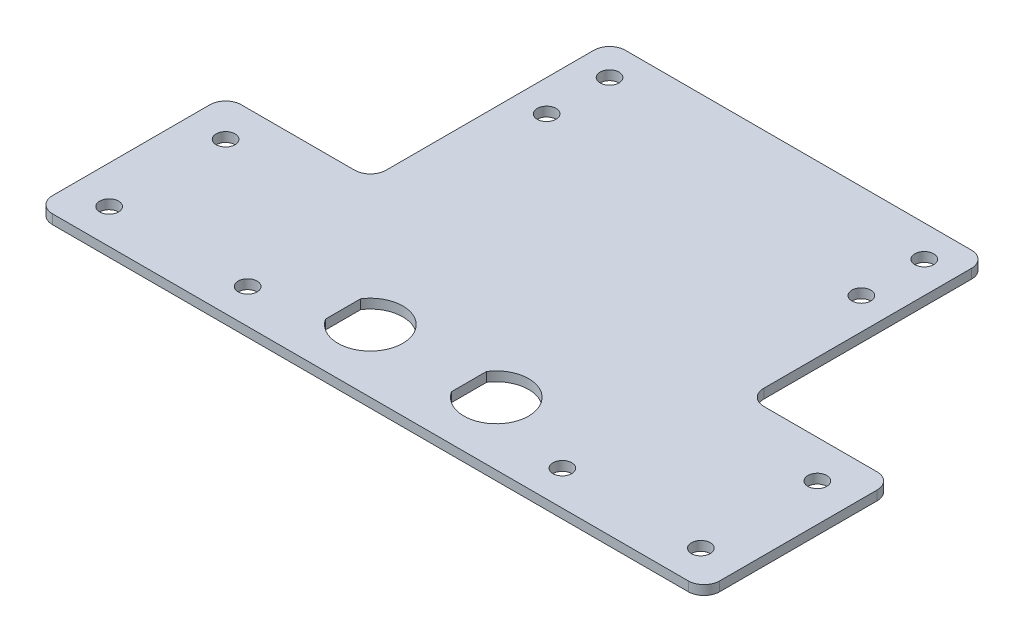
ISO-10303-21;
HEADER;
FILE_DESCRIPTION(('STEP AP214'),'2;1');
FILE_NAME('part.step','',(''),(''),'','','');
FILE_SCHEMA(('AUTOMOTIVE_DESIGN { 1 0 10303 214 1 1 1 1 }'));
ENDSEC;
DATA;
#1=APPLICATION_CONTEXT('core data for automotive mechanical design processes');
#2=APPLICATION_PROTOCOL_DEFINITION('international standard','automotive_design',2000,#1);
#3=PRODUCT_CONTEXT('',#1,'mechanical');
#4=PRODUCT('Part','Part','',(#3));
#5=PRODUCT_RELATED_PRODUCT_CATEGORY('part','',(#4));
#6=PRODUCT_DEFINITION_FORMATION('','',#4);
#7=PRODUCT_DEFINITION_CONTEXT('part definition',#1,'design');
#8=PRODUCT_DEFINITION('design','',#6,#7);
#9=PRODUCT_DEFINITION_SHAPE('','',#8);
#10=(LENGTH_UNIT() NAMED_UNIT(*) SI_UNIT(.MILLI.,.METRE.));
#11=(NAMED_UNIT(*) PLANE_ANGLE_UNIT() SI_UNIT($,.RADIAN.));
#12=(NAMED_UNIT(*) SI_UNIT($,.STERADIAN.) SOLID_ANGLE_UNIT());
#13=UNCERTAINTY_MEASURE_WITH_UNIT(LENGTH_MEASURE(1.E-05),#10,'distance_accuracy_value','');
#14=(GEOMETRIC_REPRESENTATION_CONTEXT(3) GLOBAL_UNCERTAINTY_ASSIGNED_CONTEXT((#13)) GLOBAL_UNIT_ASSIGNED_CONTEXT((#10,
#11,#12)) REPRESENTATION_CONTEXT('',''));
#15=CARTESIAN_POINT('',(0.,0.,0.));
#16=DIRECTION('',(0.,0.,1.));
#17=DIRECTION('',(1.,0.,0.));
#18=AXIS2_PLACEMENT_3D('',#15,#16,#17);
#19=CARTESIAN_POINT('',(-60.,3.,67.5));
#20=DIRECTION('',(-1.,0.,0.));
#21=DIRECTION('',(0.,0.,1.));
#22=AXIS2_PLACEMENT_3D('',#19,#20,#21);
#23=PLANE('',#22);
#24=DIRECTION('',(0.,0.,-1.));
#25=VECTOR('',#24,1.);
#26=CARTESIAN_POINT('',(-60.,3.,67.5));
#27=LINE('',#26,#25);
#28=CARTESIAN_POINT('',(-60.,3.,3.49999999999999));
#29=VERTEX_POINT('',#28);
#30=CARTESIAN_POINT('',(-60.,3.,-62.5));
#31=VERTEX_POINT('',#30);
#32=EDGE_CURVE('E232',#29,#31,#27,.T.);
#33=ORIENTED_EDGE('',*,*,#32,.T.);
#34=DIRECTION('',(0.,-1.,0.));
#35=VECTOR('',#34,1.);
#36=CARTESIAN_POINT('',(-60.,3.,-62.5));
#37=LINE('',#36,#35);
#38=CARTESIAN_POINT('',(-60.,0.,-62.5));
#39=VERTEX_POINT('',#38);
#40=EDGE_CURVE('E171',#31,#39,#37,.T.);
#41=ORIENTED_EDGE('',*,*,#40,.T.);
#42=DIRECTION('',(0.,0.,-1.));
#43=VECTOR('',#42,1.);
#44=CARTESIAN_POINT('',(-60.,0.,67.5));
#45=LINE('',#44,#43);
#46=CARTESIAN_POINT('',(-60.,0.,3.49999999999999));
#47=VERTEX_POINT('',#46);
#48=EDGE_CURVE('E246',#47,#39,#45,.T.);
#49=ORIENTED_EDGE('',*,*,#48,.F.);
#50=DIRECTION('',(0.,1.,0.));
#51=VECTOR('',#50,1.);
#52=CARTESIAN_POINT('',(-60.,3.,3.49999999999999));
#53=LINE('',#52,#51);
#54=EDGE_CURVE('E174',#47,#29,#53,.T.);
#55=ORIENTED_EDGE('',*,*,#54,.T.);
#56=EDGE_LOOP('',(#33,#41,#49,#55));
#57=FACE_BOUND('',#56,.T.);
#58=ADVANCED_FACE('F41',(#57),#23,.T.);
#59=CARTESIAN_POINT('',(60.,3.,-67.5));
#60=DIRECTION('',(1.,0.,0.));
#61=DIRECTION('',(0.,0.,1.));
#62=AXIS2_PLACEMENT_3D('',#59,#60,#61);
#63=PLANE('',#62);
#64=DIRECTION('',(0.,0.,1.));
#65=VECTOR('',#64,1.);
#66=CARTESIAN_POINT('',(60.,3.,-67.5));
#67=LINE('',#66,#65);
#68=CARTESIAN_POINT('',(60.,3.,-62.5));
#69=VERTEX_POINT('',#68);
#70=CARTESIAN_POINT('',(60.,3.,3.5));
#71=VERTEX_POINT('',#70);
#72=EDGE_CURVE('E231',#69,#71,#67,.T.);
#73=ORIENTED_EDGE('',*,*,#72,.T.);
#74=DIRECTION('',(0.,1.,0.));
#75=VECTOR('',#74,1.);
#76=CARTESIAN_POINT('',(60.,0.,3.5));
#77=LINE('',#76,#75);
#78=CARTESIAN_POINT('',(60.,0.,3.5));
#79=VERTEX_POINT('',#78);
#80=EDGE_CURVE('E219',#71,#79,#77,.F.);
#81=ORIENTED_EDGE('',*,*,#80,.T.);
#82=DIRECTION('',(0.,0.,1.));
#83=VECTOR('',#82,1.);
#84=CARTESIAN_POINT('',(60.,0.,-67.5));
#85=LINE('',#84,#83);
#86=CARTESIAN_POINT('',(60.,0.,-62.5));
#87=VERTEX_POINT('',#86);
#88=EDGE_CURVE('E124',#87,#79,#85,.T.);
#89=ORIENTED_EDGE('',*,*,#88,.F.);
#90=DIRECTION('',(0.,-1.,0.));
#91=VECTOR('',#90,1.);
#92=CARTESIAN_POINT('',(60.,3.,-62.5));
#93=LINE('',#92,#91);
#94=EDGE_CURVE('E222',#87,#69,#93,.F.);
#95=ORIENTED_EDGE('',*,*,#94,.T.);
#96=EDGE_LOOP('',(#73,#81,#89,#95));
#97=FACE_BOUND('',#96,.T.);
#98=ADVANCED_FACE('F382',(#97),#63,.T.);
#99=CARTESIAN_POINT('',(-60.,3.,-67.5));
#100=DIRECTION('',(0.,0.,-1.));
#101=DIRECTION('',(0.,-1.,0.));
#102=AXIS2_PLACEMENT_3D('',#99,#100,#101);
#103=PLANE('',#102);
#104=DIRECTION('',(1.,0.,0.));
#105=VECTOR('',#104,1.);
#106=CARTESIAN_POINT('',(-60.,3.,-67.5));
#107=LINE('',#106,#105);
#108=CARTESIAN_POINT('',(-55.,3.,-67.5));
#109=VERTEX_POINT('',#108);
#110=CARTESIAN_POINT('',(55.,3.,-67.5));
#111=VERTEX_POINT('',#110);
#112=EDGE_CURVE('E131',#109,#111,#107,.T.);
#113=ORIENTED_EDGE('',*,*,#112,.T.);
#114=DIRECTION('',(0.,-1.,0.));
#115=VECTOR('',#114,1.);
#116=CARTESIAN_POINT('',(55.,3.,-67.5));
#117=LINE('',#116,#115);
#118=CARTESIAN_POINT('',(55.,0.,-67.5));
#119=VERTEX_POINT('',#118);
#120=EDGE_CURVE('E213',#111,#119,#117,.T.);
#121=ORIENTED_EDGE('',*,*,#120,.T.);
#122=DIRECTION('',(1.,0.,0.));
#123=VECTOR('',#122,1.);
#124=CARTESIAN_POINT('',(-60.,0.,-67.5));
#125=LINE('',#124,#123);
#126=CARTESIAN_POINT('',(-55.,0.,-67.5));
#127=VERTEX_POINT('',#126);
#128=EDGE_CURVE('E240',#127,#119,#125,.T.);
#129=ORIENTED_EDGE('',*,*,#128,.F.);
#130=DIRECTION('',(0.,-1.,0.));
#131=VECTOR('',#130,1.);
#132=CARTESIAN_POINT('',(-55.,3.,-67.5));
#133=LINE('',#132,#131);
#134=EDGE_CURVE('E216',#127,#109,#133,.F.);
#135=ORIENTED_EDGE('',*,*,#134,.T.);
#136=EDGE_LOOP('',(#113,#121,#129,#135));
#137=FACE_BOUND('',#136,.T.);
#138=ADVANCED_FACE('F352',(#137),#103,.T.);
#139=CARTESIAN_POINT('',(0.,3.,0.));
#140=DIRECTION('',(0.,-1.,0.));
#141=DIRECTION('',(0.,0.,-1.));
#142=AXIS2_PLACEMENT_3D('',#139,#140,#141);
#143=PLANE('',#142);
#144=CARTESIAN_POINT('',(-50.,3.,-57.5));
#145=DIRECTION('',(0.,1.,0.));
#146=DIRECTION('',(0.,0.,1.));
#147=AXIS2_PLACEMENT_3D('',#144,#145,#146);
#148=CIRCLE('',#147,3.);
#149=CARTESIAN_POINT('',(-50.,3.,-54.5));
#150=VERTEX_POINT('',#149);
#151=EDGE_CURVE('E331',#150,#150,#148,.T.);
#152=ORIENTED_EDGE('',*,*,#151,.F.);
#153=EDGE_LOOP('',(#152));
#154=FACE_BOUND('',#153,.T.);
#155=CARTESIAN_POINT('',(50.,3.,-57.5));
#156=DIRECTION('',(0.,1.,0.));
#157=DIRECTION('',(0.,0.,-1.));
#158=AXIS2_PLACEMENT_3D('',#155,#156,#157);
#159=CIRCLE('',#158,3.);
#160=CARTESIAN_POINT('',(50.,3.,-60.5));
#161=VERTEX_POINT('',#160);
#162=EDGE_CURVE('E325',#161,#161,#159,.T.);
#163=ORIENTED_EDGE('',*,*,#162,.F.);
#164=EDGE_LOOP('',(#163));
#165=FACE_BOUND('',#164,.T.);
#166=CARTESIAN_POINT('',(50.,3.,57.5));
#167=DIRECTION('',(0.,1.,0.));
#168=DIRECTION('',(0.,0.,-1.));
#169=AXIS2_PLACEMENT_3D('',#166,#167,#168);
#170=CIRCLE('',#169,3.);
#171=CARTESIAN_POINT('',(50.,3.,54.5));
#172=VERTEX_POINT('',#171);
#173=EDGE_CURVE('E319',#172,#172,#170,.T.);
#174=ORIENTED_EDGE('',*,*,#173,.F.);
#175=EDGE_LOOP('',(#174));
#176=FACE_BOUND('',#175,.T.);
#177=CARTESIAN_POINT('',(-50.,3.,-37.5));
#178=DIRECTION('',(0.,1.,0.));
#179=DIRECTION('',(0.,0.,1.));
#180=AXIS2_PLACEMENT_3D('',#177,#178,#179);
#181=CIRCLE('',#180,3.);
#182=CARTESIAN_POINT('',(-50.,3.,-34.5));
#183=VERTEX_POINT('',#182);
#184=EDGE_CURVE('E312',#183,#183,#181,.T.);
#185=ORIENTED_EDGE('',*,*,#184,.F.);
#186=EDGE_LOOP('',(#185));
#187=FACE_BOUND('',#186,.T.);
#188=CARTESIAN_POINT('',(50.,3.,-37.5));
#189=DIRECTION('',(0.,1.,0.));
#190=DIRECTION('',(0.,0.,-1.));
#191=AXIS2_PLACEMENT_3D('',#188,#189,#190);
#192=CIRCLE('',#191,3.);
#193=CARTESIAN_POINT('',(50.,3.,-40.5));
#194=VERTEX_POINT('',#193);
#195=EDGE_CURVE('E116',#194,#194,#192,.T.);
#196=ORIENTED_EDGE('',*,*,#195,.F.);
#197=EDGE_LOOP('',(#196));
#198=FACE_BOUND('',#197,.T.);
#199=CARTESIAN_POINT('',(-50.,3.,57.5));
#200=DIRECTION('',(0.,1.,0.));
#201=DIRECTION('',(0.,0.,1.));
#202=AXIS2_PLACEMENT_3D('',#199,#200,#201);
#203=CIRCLE('',#202,3.);
#204=CARTESIAN_POINT('',(-50.,3.,60.5));
#205=VERTEX_POINT('',#204);
#206=EDGE_CURVE('E306',#205,#205,#203,.T.);
#207=ORIENTED_EDGE('',*,*,#206,.F.);
#208=EDGE_LOOP('',(#207));
#209=FACE_BOUND('',#208,.T.);
#210=ORIENTED_EDGE('',*,*,#72,.F.);
#211=CARTESIAN_POINT('',(55.,3.,-62.5));
#212=DIRECTION('',(0.,-1.,0.));
#213=DIRECTION('',(0.,0.,-1.));
#214=AXIS2_PLACEMENT_3D('',#211,#212,#213);
#215=CIRCLE('',#214,5.);
#216=EDGE_CURVE('E177',#69,#111,#215,.F.);
#217=ORIENTED_EDGE('',*,*,#216,.T.);
#218=ORIENTED_EDGE('',*,*,#112,.F.);
#219=CARTESIAN_POINT('',(-55.,3.,-62.5));
#220=DIRECTION('',(0.,-1.,0.));
#221=DIRECTION('',(0.,0.,-1.));
#222=AXIS2_PLACEMENT_3D('',#219,#220,#221);
#223=CIRCLE('',#222,5.);
#224=EDGE_CURVE('E180',#109,#31,#223,.F.);
#225=ORIENTED_EDGE('',*,*,#224,.T.);
#226=ORIENTED_EDGE('',*,*,#32,.F.);
#227=CARTESIAN_POINT('',(-65.,3.,3.49999999999999));
#228=DIRECTION('',(0.,-1.,0.));
#229=DIRECTION('',(0.,0.,-1.));
#230=AXIS2_PLACEMENT_3D('',#227,#228,#229);
#231=CIRCLE('',#230,5.);
#232=CARTESIAN_POINT('',(-65.,3.,8.5));
#233=VERTEX_POINT('',#232);
#234=EDGE_CURVE('E50',#29,#233,#231,.T.);
#235=ORIENTED_EDGE('',*,*,#234,.T.);
#236=DIRECTION('',(-1.,0.,0.));
#237=VECTOR('',#236,1.);
#238=CARTESIAN_POINT('',(-60.,3.,8.49999999999999));
#239=LINE('',#238,#237);
#240=CARTESIAN_POINT('',(-101.,3.,8.50000000000002));
#241=VERTEX_POINT('',#240);
#242=EDGE_CURVE('E262',#233,#241,#239,.T.);
#243=ORIENTED_EDGE('',*,*,#242,.T.);
#244=CARTESIAN_POINT('',(-101.,3.,13.5));
#245=DIRECTION('',(0.,-1.,0.));
#246=DIRECTION('',(0.,0.,-1.));
#247=AXIS2_PLACEMENT_3D('',#244,#245,#246);
#248=CIRCLE('',#247,5.);
#249=CARTESIAN_POINT('',(-106.,3.,13.5));
#250=VERTEX_POINT('',#249);
#251=EDGE_CURVE('E189',#241,#250,#248,.F.);
#252=ORIENTED_EDGE('',*,*,#251,.T.);
#253=DIRECTION('',(0.,0.,1.));
#254=VECTOR('',#253,1.);
#255=CARTESIAN_POINT('',(-106.,3.,68.5));
#256=LINE('',#255,#254);
#257=CARTESIAN_POINT('',(-106.,3.,63.5));
#258=VERTEX_POINT('',#257);
#259=EDGE_CURVE('E258',#250,#258,#256,.T.);
#260=ORIENTED_EDGE('',*,*,#259,.T.);
#261=CARTESIAN_POINT('',(-101.,3.,63.5));
#262=DIRECTION('',(0.,-1.,0.));
#263=DIRECTION('',(0.,0.,-1.));
#264=AXIS2_PLACEMENT_3D('',#261,#262,#263);
#265=CIRCLE('',#264,5.);
#266=CARTESIAN_POINT('',(-101.,3.,68.5));
#267=VERTEX_POINT('',#266);
#268=EDGE_CURVE('E192',#258,#267,#265,.F.);
#269=ORIENTED_EDGE('',*,*,#268,.T.);
#270=DIRECTION('',(-1.,0.,0.));
#271=VECTOR('',#270,1.);
#272=CARTESIAN_POINT('',(58.,3.,68.5));
#273=LINE('',#272,#271);
#274=CARTESIAN_POINT('',(101.,3.,68.5));
#275=VERTEX_POINT('',#274);
#276=EDGE_CURVE('E236',#275,#267,#273,.T.);
#277=ORIENTED_EDGE('',*,*,#276,.F.);
#278=CARTESIAN_POINT('',(101.,3.,63.5));
#279=DIRECTION('',(0.,-1.,0.));
#280=DIRECTION('',(0.,0.,-1.));
#281=AXIS2_PLACEMENT_3D('',#278,#279,#280);
#282=CIRCLE('',#281,5.);
#283=CARTESIAN_POINT('',(106.,3.,63.5));
#284=VERTEX_POINT('',#283);
#285=EDGE_CURVE('E183',#275,#284,#282,.F.);
#286=ORIENTED_EDGE('',*,*,#285,.T.);
#287=DIRECTION('',(0.,0.,-1.));
#288=VECTOR('',#287,1.);
#289=CARTESIAN_POINT('',(106.,3.,68.5));
#290=LINE('',#289,#288);
#291=CARTESIAN_POINT('',(106.,3.,13.5));
#292=VERTEX_POINT('',#291);
#293=EDGE_CURVE('E282',#284,#292,#290,.T.);
#294=ORIENTED_EDGE('',*,*,#293,.T.);
#295=CARTESIAN_POINT('',(101.,3.,13.5));
#296=DIRECTION('',(0.,-1.,0.));
#297=DIRECTION('',(0.,0.,-1.));
#298=AXIS2_PLACEMENT_3D('',#295,#296,#297);
#299=CIRCLE('',#298,5.);
#300=CARTESIAN_POINT('',(101.,3.,8.50000000000002));
#301=VERTEX_POINT('',#300);
#302=EDGE_CURVE('E186',#292,#301,#299,.F.);
#303=ORIENTED_EDGE('',*,*,#302,.T.);
#304=DIRECTION('',(-1.,0.,0.));
#305=VECTOR('',#304,1.);
#306=CARTESIAN_POINT('',(60.,3.,8.49999999999999));
#307=LINE('',#306,#305);
#308=CARTESIAN_POINT('',(65.,3.,8.5));
#309=VERTEX_POINT('',#308);
#310=EDGE_CURVE('E286',#301,#309,#307,.T.);
#311=ORIENTED_EDGE('',*,*,#310,.T.);
#312=CARTESIAN_POINT('',(65.,3.,3.5));
#313=DIRECTION('',(0.,-1.,0.));
#314=DIRECTION('',(0.,0.,-1.));
#315=AXIS2_PLACEMENT_3D('',#312,#313,#314);
#316=CIRCLE('',#315,5.);
#317=EDGE_CURVE('E144',#309,#71,#316,.T.);
#318=ORIENTED_EDGE('',*,*,#317,.T.);
#319=EDGE_LOOP('',(#210,#217,#218,#225,#226,#235,#243,#252,#260,#269,#277,#286,#294,#303,#311,#318));
#320=FACE_BOUND('',#319,.T.);
#321=CARTESIAN_POINT('',(-20.,3.,48.5));
#322=DIRECTION('',(0.,-1.,0.));
#323=DIRECTION('',(0.,0.,-1.));
#324=AXIS2_PLACEMENT_3D('',#321,#322,#323);
#325=CIRCLE('',#324,10.3);
#326=CARTESIAN_POINT('',(-28.6602540378444,3.,42.9241592562197));
#327=VERTEX_POINT('',#326);
#328=CARTESIAN_POINT('',(-28.6602540378444,3.,54.0758407437803));
#329=VERTEX_POINT('',#328);
#330=EDGE_CURVE('E128',#327,#329,#325,.T.);
#331=ORIENTED_EDGE('',*,*,#330,.T.);
#332=DIRECTION('',(0.,0.,-1.));
#333=VECTOR('',#332,1.);
#334=CARTESIAN_POINT('',(-28.6602540378444,3.,43.5));
#335=LINE('',#334,#333);
#336=EDGE_CURVE('E57',#329,#327,#335,.T.);
#337=ORIENTED_EDGE('',*,*,#336,.T.);
#338=EDGE_LOOP('',(#331,#337));
#339=FACE_BOUND('',#338,.T.);
#340=CARTESIAN_POINT('',(20.,3.,48.5));
#341=DIRECTION('',(0.,-1.,0.));
#342=DIRECTION('',(0.,0.,-1.));
#343=AXIS2_PLACEMENT_3D('',#340,#341,#342);
#344=CIRCLE('',#343,10.3);
#345=CARTESIAN_POINT('',(11.3397459621556,3.,42.9241592562197));
#346=VERTEX_POINT('',#345);
#347=CARTESIAN_POINT('',(11.3397459621556,3.,54.0758407437803));
#348=VERTEX_POINT('',#347);
#349=EDGE_CURVE('E115',#346,#348,#344,.T.);
#350=ORIENTED_EDGE('',*,*,#349,.T.);
#351=DIRECTION('',(0.,0.,-1.));
#352=VECTOR('',#351,1.);
#353=CARTESIAN_POINT('',(11.3397459621556,3.,43.5));
#354=LINE('',#353,#352);
#355=EDGE_CURVE('E65',#348,#346,#354,.T.);
#356=ORIENTED_EDGE('',*,*,#355,.T.);
#357=EDGE_LOOP('',(#350,#356));
#358=FACE_BOUND('',#357,.T.);
#359=CARTESIAN_POINT('',(-94.,3.,57.5));
#360=DIRECTION('',(0.,1.,0.));
#361=DIRECTION('',(0.,0.,-1.));
#362=AXIS2_PLACEMENT_3D('',#359,#360,#361);
#363=CIRCLE('',#362,3.00000000000001);
#364=CARTESIAN_POINT('',(-94.,3.,54.5));
#365=VERTEX_POINT('',#364);
#366=EDGE_CURVE('E276',#365,#365,#363,.T.);
#367=ORIENTED_EDGE('',*,*,#366,.F.);
#368=EDGE_LOOP('',(#367));
#369=FACE_BOUND('',#368,.T.);
#370=CARTESIAN_POINT('',(-94.,3.,20.5));
#371=DIRECTION('',(0.,1.,0.));
#372=DIRECTION('',(0.,0.,-1.));
#373=AXIS2_PLACEMENT_3D('',#370,#371,#372);
#374=CIRCLE('',#373,3.00000000000001);
#375=CARTESIAN_POINT('',(-94.,3.,17.5));
#376=VERTEX_POINT('',#375);
#377=EDGE_CURVE('E270',#376,#376,#374,.T.);
#378=ORIENTED_EDGE('',*,*,#377,.F.);
#379=EDGE_LOOP('',(#378));
#380=FACE_BOUND('',#379,.T.);
#381=CARTESIAN_POINT('',(94.,3.,20.5));
#382=DIRECTION('',(0.,1.,0.));
#383=DIRECTION('',(0.,0.,1.));
#384=AXIS2_PLACEMENT_3D('',#381,#382,#383);
#385=CIRCLE('',#384,3.00000000000001);
#386=CARTESIAN_POINT('',(94.,3.,23.5));
#387=VERTEX_POINT('',#386);
#388=EDGE_CURVE('E300',#387,#387,#385,.T.);
#389=ORIENTED_EDGE('',*,*,#388,.F.);
#390=EDGE_LOOP('',(#389));
#391=FACE_BOUND('',#390,.T.);
#392=CARTESIAN_POINT('',(94.,3.,57.5));
#393=DIRECTION('',(0.,1.,0.));
#394=DIRECTION('',(0.,0.,1.));
#395=AXIS2_PLACEMENT_3D('',#392,#393,#394);
#396=CIRCLE('',#395,3.00000000000001);
#397=CARTESIAN_POINT('',(94.,3.,60.5));
#398=VERTEX_POINT('',#397);
#399=EDGE_CURVE('E294',#398,#398,#396,.T.);
#400=ORIENTED_EDGE('',*,*,#399,.F.);
#401=EDGE_LOOP('',(#400));
#402=FACE_BOUND('',#401,.T.);
#403=ADVANCED_FACE('F350',(#154,#165,#176,#187,#198,#209,#320,#339,#358,#369,#380,#391,#402),
#143,.F.);
#404=CARTESIAN_POINT('',(0.,0.,0.));
#405=DIRECTION('',(0.,-1.,0.));
#406=DIRECTION('',(0.,0.,-1.));
#407=AXIS2_PLACEMENT_3D('',#404,#405,#406);
#408=PLANE('',#407);
#409=CARTESIAN_POINT('',(-50.,0.,-57.5));
#410=DIRECTION('',(0.,1.,0.));
#411=DIRECTION('',(0.,0.,1.));
#412=AXIS2_PLACEMENT_3D('',#409,#410,#411);
#413=CIRCLE('',#412,3.);
#414=CARTESIAN_POINT('',(-50.,0.,-54.5));
#415=VERTEX_POINT('',#414);
#416=EDGE_CURVE('E309',#415,#415,#413,.T.);
#417=ORIENTED_EDGE('',*,*,#416,.T.);
#418=EDGE_LOOP('',(#417));
#419=FACE_BOUND('',#418,.T.);
#420=CARTESIAN_POINT('',(50.,0.,-57.5));
#421=DIRECTION('',(0.,1.,0.));
#422=DIRECTION('',(0.,0.,-1.));
#423=AXIS2_PLACEMENT_3D('',#420,#421,#422);
#424=CIRCLE('',#423,3.);
#425=CARTESIAN_POINT('',(50.,0.,-60.5));
#426=VERTEX_POINT('',#425);
#427=EDGE_CURVE('E328',#426,#426,#424,.T.);
#428=ORIENTED_EDGE('',*,*,#427,.T.);
#429=EDGE_LOOP('',(#428));
#430=FACE_BOUND('',#429,.T.);
#431=CARTESIAN_POINT('',(50.,0.,57.5));
#432=DIRECTION('',(0.,1.,0.));
#433=DIRECTION('',(0.,0.,-1.));
#434=AXIS2_PLACEMENT_3D('',#431,#432,#433);
#435=CIRCLE('',#434,3.);
#436=CARTESIAN_POINT('',(50.,0.,54.5));
#437=VERTEX_POINT('',#436);
#438=EDGE_CURVE('E322',#437,#437,#435,.T.);
#439=ORIENTED_EDGE('',*,*,#438,.T.);
#440=EDGE_LOOP('',(#439));
#441=FACE_BOUND('',#440,.T.);
#442=CARTESIAN_POINT('',(-50.,0.,-37.5));
#443=DIRECTION('',(0.,1.,0.));
#444=DIRECTION('',(0.,0.,1.));
#445=AXIS2_PLACEMENT_3D('',#442,#443,#444);
#446=CIRCLE('',#445,3.);
#447=CARTESIAN_POINT('',(-50.,0.,-34.5));
#448=VERTEX_POINT('',#447);
#449=EDGE_CURVE('E315',#448,#448,#446,.T.);
#450=ORIENTED_EDGE('',*,*,#449,.T.);
#451=EDGE_LOOP('',(#450));
#452=FACE_BOUND('',#451,.T.);
#453=CARTESIAN_POINT('',(50.,0.,-37.5));
#454=DIRECTION('',(0.,1.,0.));
#455=DIRECTION('',(0.,0.,-1.));
#456=AXIS2_PLACEMENT_3D('',#453,#454,#455);
#457=CIRCLE('',#456,3.);
#458=CARTESIAN_POINT('',(50.,0.,-40.5));
#459=VERTEX_POINT('',#458);
#460=EDGE_CURVE('E316',#459,#459,#457,.T.);
#461=ORIENTED_EDGE('',*,*,#460,.T.);
#462=EDGE_LOOP('',(#461));
#463=FACE_BOUND('',#462,.T.);
#464=CARTESIAN_POINT('',(-50.,0.,57.5));
#465=DIRECTION('',(0.,1.,0.));
#466=DIRECTION('',(0.,0.,1.));
#467=AXIS2_PLACEMENT_3D('',#464,#465,#466);
#468=CIRCLE('',#467,3.);
#469=CARTESIAN_POINT('',(-50.,0.,60.5));
#470=VERTEX_POINT('',#469);
#471=EDGE_CURVE('E303',#470,#470,#468,.T.);
#472=ORIENTED_EDGE('',*,*,#471,.T.);
#473=EDGE_LOOP('',(#472));
#474=FACE_BOUND('',#473,.T.);
#475=ORIENTED_EDGE('',*,*,#128,.T.);
#476=CARTESIAN_POINT('',(55.,0.,-62.5));
#477=DIRECTION('',(0.,-1.,0.));
#478=DIRECTION('',(0.,0.,-1.));
#479=AXIS2_PLACEMENT_3D('',#476,#477,#478);
#480=CIRCLE('',#479,5.);
#481=EDGE_CURVE('E195',#119,#87,#480,.T.);
#482=ORIENTED_EDGE('',*,*,#481,.T.);
#483=ORIENTED_EDGE('',*,*,#88,.T.);
#484=CARTESIAN_POINT('',(65.,0.,3.5));
#485=DIRECTION('',(0.,-1.,0.));
#486=DIRECTION('',(0.,0.,-1.));
#487=AXIS2_PLACEMENT_3D('',#484,#485,#486);
#488=CIRCLE('',#487,5.);
#489=CARTESIAN_POINT('',(65.,0.,8.5));
#490=VERTEX_POINT('',#489);
#491=EDGE_CURVE('E141',#79,#490,#488,.F.);
#492=ORIENTED_EDGE('',*,*,#491,.T.);
#493=DIRECTION('',(-1.,0.,0.));
#494=VECTOR('',#493,1.);
#495=CARTESIAN_POINT('',(60.,0.,8.49999999999999));
#496=LINE('',#495,#494);
#497=CARTESIAN_POINT('',(101.,0.,8.50000000000002));
#498=VERTEX_POINT('',#497);
#499=EDGE_CURVE('E285',#498,#490,#496,.T.);
#500=ORIENTED_EDGE('',*,*,#499,.F.);
#501=CARTESIAN_POINT('',(101.,0.,13.5));
#502=DIRECTION('',(0.,-1.,0.));
#503=DIRECTION('',(0.,0.,-1.));
#504=AXIS2_PLACEMENT_3D('',#501,#502,#503);
#505=CIRCLE('',#504,5.);
#506=CARTESIAN_POINT('',(106.,0.,13.5));
#507=VERTEX_POINT('',#506);
#508=EDGE_CURVE('E204',#498,#507,#505,.T.);
#509=ORIENTED_EDGE('',*,*,#508,.T.);
#510=DIRECTION('',(0.,0.,-1.));
#511=VECTOR('',#510,1.);
#512=CARTESIAN_POINT('',(106.,0.,68.5));
#513=LINE('',#512,#511);
#514=CARTESIAN_POINT('',(106.,0.,63.5));
#515=VERTEX_POINT('',#514);
#516=EDGE_CURVE('E279',#515,#507,#513,.T.);
#517=ORIENTED_EDGE('',*,*,#516,.F.);
#518=CARTESIAN_POINT('',(101.,0.,63.5));
#519=DIRECTION('',(0.,-1.,0.));
#520=DIRECTION('',(0.,0.,-1.));
#521=AXIS2_PLACEMENT_3D('',#518,#519,#520);
#522=CIRCLE('',#521,5.);
#523=CARTESIAN_POINT('',(101.,0.,68.5));
#524=VERTEX_POINT('',#523);
#525=EDGE_CURVE('E201',#515,#524,#522,.T.);
#526=ORIENTED_EDGE('',*,*,#525,.T.);
#527=DIRECTION('',(-1.,0.,0.));
#528=VECTOR('',#527,1.);
#529=CARTESIAN_POINT('',(58.,0.,68.5));
#530=LINE('',#529,#528);
#531=CARTESIAN_POINT('',(-101.,0.,68.5));
#532=VERTEX_POINT('',#531);
#533=EDGE_CURVE('E242',#524,#532,#530,.T.);
#534=ORIENTED_EDGE('',*,*,#533,.T.);
#535=CARTESIAN_POINT('',(-101.,0.,63.5));
#536=DIRECTION('',(0.,-1.,0.));
#537=DIRECTION('',(0.,0.,-1.));
#538=AXIS2_PLACEMENT_3D('',#535,#536,#537);
#539=CIRCLE('',#538,5.);
#540=CARTESIAN_POINT('',(-106.,0.,63.5));
#541=VERTEX_POINT('',#540);
#542=EDGE_CURVE('E210',#532,#541,#539,.T.);
#543=ORIENTED_EDGE('',*,*,#542,.T.);
#544=DIRECTION('',(0.,0.,1.));
#545=VECTOR('',#544,1.);
#546=CARTESIAN_POINT('',(-106.,0.,68.5));
#547=LINE('',#546,#545);
#548=CARTESIAN_POINT('',(-106.,0.,13.5));
#549=VERTEX_POINT('',#548);
#550=EDGE_CURVE('E241',#549,#541,#547,.T.);
#551=ORIENTED_EDGE('',*,*,#550,.F.);
#552=CARTESIAN_POINT('',(-101.,0.,13.5));
#553=DIRECTION('',(0.,-1.,0.));
#554=DIRECTION('',(0.,0.,-1.));
#555=AXIS2_PLACEMENT_3D('',#552,#553,#554);
#556=CIRCLE('',#555,5.);
#557=CARTESIAN_POINT('',(-101.,0.,8.50000000000002));
#558=VERTEX_POINT('',#557);
#559=EDGE_CURVE('E207',#549,#558,#556,.T.);
#560=ORIENTED_EDGE('',*,*,#559,.T.);
#561=DIRECTION('',(-1.,0.,0.));
#562=VECTOR('',#561,1.);
#563=CARTESIAN_POINT('',(-60.,0.,8.49999999999999));
#564=LINE('',#563,#562);
#565=CARTESIAN_POINT('',(-65.,0.,8.5));
#566=VERTEX_POINT('',#565);
#567=EDGE_CURVE('E261',#566,#558,#564,.T.);
#568=ORIENTED_EDGE('',*,*,#567,.F.);
#569=CARTESIAN_POINT('',(-65.,0.,3.49999999999999));
#570=DIRECTION('',(0.,-1.,0.));
#571=DIRECTION('',(0.,0.,-1.));
#572=AXIS2_PLACEMENT_3D('',#569,#570,#571);
#573=CIRCLE('',#572,5.);
#574=EDGE_CURVE('E12',#566,#47,#573,.F.);
#575=ORIENTED_EDGE('',*,*,#574,.T.);
#576=ORIENTED_EDGE('',*,*,#48,.T.);
#577=CARTESIAN_POINT('',(-55.,0.,-62.5));
#578=DIRECTION('',(0.,-1.,0.));
#579=DIRECTION('',(0.,0.,-1.));
#580=AXIS2_PLACEMENT_3D('',#577,#578,#579);
#581=CIRCLE('',#580,5.);
#582=EDGE_CURVE('E198',#39,#127,#581,.T.);
#583=ORIENTED_EDGE('',*,*,#582,.T.);
#584=EDGE_LOOP('',(#475,#482,#483,#492,#500,#509,#517,#526,#534,#543,#551,#560,#568,#575,#576,#583));
#585=FACE_BOUND('',#584,.T.);
#586=CARTESIAN_POINT('',(-20.,0.,48.5));
#587=DIRECTION('',(0.,-1.,0.));
#588=DIRECTION('',(0.,0.,-1.));
#589=AXIS2_PLACEMENT_3D('',#586,#587,#588);
#590=CIRCLE('',#589,10.3);
#591=CARTESIAN_POINT('',(-20.,0.,38.2));
#592=VERTEX_POINT('',#591);
#593=CARTESIAN_POINT('',(-28.6602540378444,0.,42.9241592562197));
#594=VERTEX_POINT('',#593);
#595=EDGE_CURVE('E122',#592,#594,#590,.F.);
#596=ORIENTED_EDGE('',*,*,#595,.T.);
#597=DIRECTION('',(0.,0.,-1.));
#598=VECTOR('',#597,1.);
#599=CARTESIAN_POINT('',(-28.6602540378444,0.,43.5));
#600=LINE('',#599,#598);
#601=CARTESIAN_POINT('',(-28.6602540378444,0.,54.0758407437803));
#602=VERTEX_POINT('',#601);
#603=EDGE_CURVE('E88',#602,#594,#600,.T.);
#604=ORIENTED_EDGE('',*,*,#603,.F.);
#605=CARTESIAN_POINT('',(-20.,0.,48.5));
#606=DIRECTION('',(0.,-1.,0.));
#607=DIRECTION('',(0.,0.,-1.));
#608=AXIS2_PLACEMENT_3D('',#605,#606,#607);
#609=CIRCLE('',#608,10.3);
#610=EDGE_CURVE('E120',#602,#592,#609,.F.);
#611=ORIENTED_EDGE('',*,*,#610,.T.);
#612=EDGE_LOOP('',(#596,#604,#611));
#613=FACE_BOUND('',#612,.T.);
#614=CARTESIAN_POINT('',(20.,0.,48.5));
#615=DIRECTION('',(0.,-1.,0.));
#616=DIRECTION('',(0.,0.,-1.));
#617=AXIS2_PLACEMENT_3D('',#614,#615,#616);
#618=CIRCLE('',#617,10.3);
#619=CARTESIAN_POINT('',(20.,0.,38.2));
#620=VERTEX_POINT('',#619);
#621=CARTESIAN_POINT('',(11.3397459621556,0.,42.9241592562197));
#622=VERTEX_POINT('',#621);
#623=EDGE_CURVE('E114',#620,#622,#618,.F.);
#624=ORIENTED_EDGE('',*,*,#623,.T.);
#625=DIRECTION('',(0.,0.,-1.));
#626=VECTOR('',#625,1.);
#627=CARTESIAN_POINT('',(11.3397459621556,0.,43.5));
#628=LINE('',#627,#626);
#629=CARTESIAN_POINT('',(11.3397459621556,0.,54.0758407437803));
#630=VERTEX_POINT('',#629);
#631=EDGE_CURVE('E105',#630,#622,#628,.T.);
#632=ORIENTED_EDGE('',*,*,#631,.F.);
#633=CARTESIAN_POINT('',(20.,0.,48.5));
#634=DIRECTION('',(0.,-1.,0.));
#635=DIRECTION('',(0.,0.,-1.));
#636=AXIS2_PLACEMENT_3D('',#633,#634,#635);
#637=CIRCLE('',#636,10.3);
#638=EDGE_CURVE('E102',#630,#620,#637,.F.);
#639=ORIENTED_EDGE('',*,*,#638,.T.);
#640=EDGE_LOOP('',(#624,#632,#639));
#641=FACE_BOUND('',#640,.T.);
#642=CARTESIAN_POINT('',(-94.,0.,57.5));
#643=DIRECTION('',(0.,1.,0.));
#644=DIRECTION('',(0.,0.,-1.));
#645=AXIS2_PLACEMENT_3D('',#642,#643,#644);
#646=CIRCLE('',#645,3.00000000000001);
#647=CARTESIAN_POINT('',(-94.,0.,54.5));
#648=VERTEX_POINT('',#647);
#649=EDGE_CURVE('E273',#648,#648,#646,.T.);
#650=ORIENTED_EDGE('',*,*,#649,.T.);
#651=EDGE_LOOP('',(#650));
#652=FACE_BOUND('',#651,.T.);
#653=CARTESIAN_POINT('',(-94.,0.,20.5));
#654=DIRECTION('',(0.,1.,0.));
#655=DIRECTION('',(0.,0.,-1.));
#656=AXIS2_PLACEMENT_3D('',#653,#654,#655);
#657=CIRCLE('',#656,3.00000000000001);
#658=CARTESIAN_POINT('',(-94.,0.,17.5));
#659=VERTEX_POINT('',#658);
#660=EDGE_CURVE('E265',#659,#659,#657,.T.);
#661=ORIENTED_EDGE('',*,*,#660,.T.);
#662=EDGE_LOOP('',(#661));
#663=FACE_BOUND('',#662,.T.);
#664=CARTESIAN_POINT('',(94.,0.,20.5));
#665=DIRECTION('',(0.,1.,0.));
#666=DIRECTION('',(0.,0.,1.));
#667=AXIS2_PLACEMENT_3D('',#664,#665,#666);
#668=CIRCLE('',#667,3.00000000000001);
#669=CARTESIAN_POINT('',(94.,0.,23.5));
#670=VERTEX_POINT('',#669);
#671=EDGE_CURVE('E297',#670,#670,#668,.T.);
#672=ORIENTED_EDGE('',*,*,#671,.T.);
#673=EDGE_LOOP('',(#672));
#674=FACE_BOUND('',#673,.T.);
#675=CARTESIAN_POINT('',(94.,0.,57.5));
#676=DIRECTION('',(0.,1.,0.));
#677=DIRECTION('',(0.,0.,1.));
#678=AXIS2_PLACEMENT_3D('',#675,#676,#677);
#679=CIRCLE('',#678,3.00000000000001);
#680=CARTESIAN_POINT('',(94.,0.,60.5));
#681=VERTEX_POINT('',#680);
#682=EDGE_CURVE('E289',#681,#681,#679,.T.);
#683=ORIENTED_EDGE('',*,*,#682,.T.);
#684=EDGE_LOOP('',(#683));
#685=FACE_BOUND('',#684,.T.);
#686=ADVANCED_FACE('F118',(#419,#430,#441,#452,#463,#474,#585,#613,#641,#652,#663,#674,#685),
#408,.T.);
#687=CARTESIAN_POINT('',(58.,0.,68.5));
#688=DIRECTION('',(0.,0.,-1.));
#689=DIRECTION('',(0.,-1.,0.));
#690=AXIS2_PLACEMENT_3D('',#687,#688,#689);
#691=PLANE('',#690);
#692=ORIENTED_EDGE('',*,*,#533,.F.);
#693=DIRECTION('',(0.,1.,0.));
#694=VECTOR('',#693,1.);
#695=CARTESIAN_POINT('',(101.,3.,68.5));
#696=LINE('',#695,#694);
#697=EDGE_CURVE('E159',#524,#275,#696,.T.);
#698=ORIENTED_EDGE('',*,*,#697,.T.);
#699=ORIENTED_EDGE('',*,*,#276,.T.);
#700=DIRECTION('',(0.,1.,0.));
#701=VECTOR('',#700,1.);
#702=CARTESIAN_POINT('',(-101.,0.,68.5));
#703=LINE('',#702,#701);
#704=EDGE_CURVE('E162',#267,#532,#703,.F.);
#705=ORIENTED_EDGE('',*,*,#704,.T.);
#706=EDGE_LOOP('',(#692,#698,#699,#705));
#707=FACE_BOUND('',#706,.T.);
#708=ADVANCED_FACE('F392',(#707),#691,.F.);
#709=CARTESIAN_POINT('',(20.,-140.624572252627,48.5));
#710=DIRECTION('',(0.,1.,0.));
#711=DIRECTION('',(0.,0.,1.));
#712=AXIS2_PLACEMENT_3D('',#709,#710,#711);
#713=CYLINDRICAL_SURFACE('',#712,10.3);
#714=ORIENTED_EDGE('',*,*,#349,.F.);
#715=DIRECTION('',(0.,1.,0.));
#716=VECTOR('',#715,1.);
#717=CARTESIAN_POINT('',(11.3397459621556,0.,42.9241592562197));
#718=LINE('',#717,#716);
#719=EDGE_CURVE('E108',#622,#346,#718,.T.);
#720=ORIENTED_EDGE('',*,*,#719,.F.);
#721=ORIENTED_EDGE('',*,*,#623,.F.);
#722=ORIENTED_EDGE('',*,*,#638,.F.);
#723=DIRECTION('',(0.,1.,0.));
#724=VECTOR('',#723,1.);
#725=CARTESIAN_POINT('',(11.3397459621556,-140.624572252627,54.0758407437803));
#726=LINE('',#725,#724);
#727=EDGE_CURVE('E110',#630,#348,#726,.T.);
#728=ORIENTED_EDGE('',*,*,#727,.T.);
#729=EDGE_LOOP('',(#714,#720,#721,#722,#728));
#730=FACE_BOUND('',#729,.T.);
#731=ADVANCED_FACE('F113',(#730),#713,.F.);
#732=CARTESIAN_POINT('',(-20.,-140.624572252627,48.5));
#733=DIRECTION('',(0.,1.,0.));
#734=DIRECTION('',(0.,0.,1.));
#735=AXIS2_PLACEMENT_3D('',#732,#733,#734);
#736=CYLINDRICAL_SURFACE('',#735,10.3);
#737=ORIENTED_EDGE('',*,*,#330,.F.);
#738=DIRECTION('',(0.,1.,0.));
#739=VECTOR('',#738,1.);
#740=CARTESIAN_POINT('',(-28.6602540378444,0.,42.9241592562197));
#741=LINE('',#740,#739);
#742=EDGE_CURVE('E45',#594,#327,#741,.T.);
#743=ORIENTED_EDGE('',*,*,#742,.F.);
#744=ORIENTED_EDGE('',*,*,#595,.F.);
#745=ORIENTED_EDGE('',*,*,#610,.F.);
#746=DIRECTION('',(0.,1.,0.));
#747=VECTOR('',#746,1.);
#748=CARTESIAN_POINT('',(-28.6602540378444,-140.624572252627,54.0758407437803));
#749=LINE('',#748,#747);
#750=EDGE_CURVE('E132',#602,#329,#749,.T.);
#751=ORIENTED_EDGE('',*,*,#750,.T.);
#752=EDGE_LOOP('',(#737,#743,#744,#745,#751));
#753=FACE_BOUND('',#752,.T.);
#754=ADVANCED_FACE('F43',(#753),#736,.F.);
#755=CARTESIAN_POINT('',(-60.,0.,8.49999999999999));
#756=DIRECTION('',(0.,0.,-1.));
#757=DIRECTION('',(-1.,0.,0.));
#758=AXIS2_PLACEMENT_3D('',#755,#756,#757);
#759=PLANE('',#758);
#760=ORIENTED_EDGE('',*,*,#242,.F.);
#761=DIRECTION('',(0.,1.,0.));
#762=VECTOR('',#761,1.);
#763=CARTESIAN_POINT('',(-65.,0.,8.5));
#764=LINE('',#763,#762);
#765=EDGE_CURVE('E165',#233,#566,#764,.F.);
#766=ORIENTED_EDGE('',*,*,#765,.T.);
#767=ORIENTED_EDGE('',*,*,#567,.T.);
#768=DIRECTION('',(0.,1.,0.));
#769=VECTOR('',#768,1.);
#770=CARTESIAN_POINT('',(-101.,0.,8.50000000000002));
#771=LINE('',#770,#769);
#772=EDGE_CURVE('E168',#558,#241,#771,.T.);
#773=ORIENTED_EDGE('',*,*,#772,.T.);
#774=EDGE_LOOP('',(#760,#766,#767,#773));
#775=FACE_BOUND('',#774,.T.);
#776=ADVANCED_FACE('F434',(#775),#759,.T.);
#777=CARTESIAN_POINT('',(-106.,0.,68.5));
#778=DIRECTION('',(-1.,0.,0.));
#779=DIRECTION('',(0.,0.,1.));
#780=AXIS2_PLACEMENT_3D('',#777,#778,#779);
#781=PLANE('',#780);
#782=ORIENTED_EDGE('',*,*,#259,.F.);
#783=DIRECTION('',(0.,1.,0.));
#784=VECTOR('',#783,1.);
#785=CARTESIAN_POINT('',(-106.,0.,13.5));
#786=LINE('',#785,#784);
#787=EDGE_CURVE('E147',#250,#549,#786,.F.);
#788=ORIENTED_EDGE('',*,*,#787,.T.);
#789=ORIENTED_EDGE('',*,*,#550,.T.);
#790=DIRECTION('',(0.,1.,0.));
#791=VECTOR('',#790,1.);
#792=CARTESIAN_POINT('',(-106.,3.,63.5));
#793=LINE('',#792,#791);
#794=EDGE_CURVE('E150',#541,#258,#793,.T.);
#795=ORIENTED_EDGE('',*,*,#794,.T.);
#796=EDGE_LOOP('',(#782,#788,#789,#795));
#797=FACE_BOUND('',#796,.T.);
#798=ADVANCED_FACE('F495',(#797),#781,.T.);
#799=CARTESIAN_POINT('',(-94.,0.,20.5));
#800=DIRECTION('',(0.,1.,0.));
#801=DIRECTION('',(0.,0.,1.));
#802=AXIS2_PLACEMENT_3D('',#799,#800,#801);
#803=CYLINDRICAL_SURFACE('',#802,3.00000000000001);
#804=ORIENTED_EDGE('',*,*,#660,.F.);
#805=EDGE_LOOP('',(#804));
#806=FACE_BOUND('',#805,.T.);
#807=ORIENTED_EDGE('',*,*,#377,.T.);
#808=EDGE_LOOP('',(#807));
#809=FACE_BOUND('',#808,.T.);
#810=ADVANCED_FACE('F557',(#806,#809),#803,.F.);
#811=CARTESIAN_POINT('',(-94.,0.,57.5));
#812=DIRECTION('',(0.,1.,0.));
#813=DIRECTION('',(0.,0.,1.));
#814=AXIS2_PLACEMENT_3D('',#811,#812,#813);
#815=CYLINDRICAL_SURFACE('',#814,3.00000000000001);
#816=ORIENTED_EDGE('',*,*,#649,.F.);
#817=EDGE_LOOP('',(#816));
#818=FACE_BOUND('',#817,.T.);
#819=ORIENTED_EDGE('',*,*,#366,.T.);
#820=EDGE_LOOP('',(#819));
#821=FACE_BOUND('',#820,.T.);
#822=ADVANCED_FACE('F552',(#818,#821),#815,.F.);
#823=CARTESIAN_POINT('',(60.,0.,8.49999999999999));
#824=DIRECTION('',(0.,0.,-1.));
#825=DIRECTION('',(-1.,0.,0.));
#826=AXIS2_PLACEMENT_3D('',#823,#824,#825);
#827=PLANE('',#826);
#828=ORIENTED_EDGE('',*,*,#499,.T.);
#829=DIRECTION('',(0.,1.,0.));
#830=VECTOR('',#829,1.);
#831=CARTESIAN_POINT('',(65.,3.,8.5));
#832=LINE('',#831,#830);
#833=EDGE_CURVE('E225',#490,#309,#832,.T.);
#834=ORIENTED_EDGE('',*,*,#833,.T.);
#835=ORIENTED_EDGE('',*,*,#310,.F.);
#836=DIRECTION('',(0.,1.,0.));
#837=VECTOR('',#836,1.);
#838=CARTESIAN_POINT('',(101.,0.,8.50000000000002));
#839=LINE('',#838,#837);
#840=EDGE_CURVE('E228',#301,#498,#839,.F.);
#841=ORIENTED_EDGE('',*,*,#840,.T.);
#842=EDGE_LOOP('',(#828,#834,#835,#841));
#843=FACE_BOUND('',#842,.T.);
#844=ADVANCED_FACE('F377',(#843),#827,.T.);
#845=CARTESIAN_POINT('',(106.,0.,68.5));
#846=DIRECTION('',(1.,0.,0.));
#847=DIRECTION('',(0.,0.,-1.));
#848=AXIS2_PLACEMENT_3D('',#845,#846,#847);
#849=PLANE('',#848);
#850=ORIENTED_EDGE('',*,*,#293,.F.);
#851=DIRECTION('',(0.,1.,0.));
#852=VECTOR('',#851,1.);
#853=CARTESIAN_POINT('',(106.,0.,63.5));
#854=LINE('',#853,#852);
#855=EDGE_CURVE('E153',#284,#515,#854,.F.);
#856=ORIENTED_EDGE('',*,*,#855,.T.);
#857=ORIENTED_EDGE('',*,*,#516,.T.);
#858=DIRECTION('',(0.,1.,0.));
#859=VECTOR('',#858,1.);
#860=CARTESIAN_POINT('',(106.,0.,13.5));
#861=LINE('',#860,#859);
#862=EDGE_CURVE('E156',#507,#292,#861,.T.);
#863=ORIENTED_EDGE('',*,*,#862,.T.);
#864=EDGE_LOOP('',(#850,#856,#857,#863));
#865=FACE_BOUND('',#864,.T.);
#866=ADVANCED_FACE('F367',(#865),#849,.T.);
#867=CARTESIAN_POINT('',(94.,0.,57.5));
#868=DIRECTION('',(0.,1.,0.));
#869=DIRECTION('',(0.,0.,1.));
#870=AXIS2_PLACEMENT_3D('',#867,#868,#869);
#871=CYLINDRICAL_SURFACE('',#870,3.00000000000001);
#872=ORIENTED_EDGE('',*,*,#682,.F.);
#873=EDGE_LOOP('',(#872));
#874=FACE_BOUND('',#873,.T.);
#875=ORIENTED_EDGE('',*,*,#399,.T.);
#876=EDGE_LOOP('',(#875));
#877=FACE_BOUND('',#876,.T.);
#878=ADVANCED_FACE('F364',(#874,#877),#871,.F.);
#879=CARTESIAN_POINT('',(94.,0.,20.5));
#880=DIRECTION('',(0.,1.,0.));
#881=DIRECTION('',(0.,0.,1.));
#882=AXIS2_PLACEMENT_3D('',#879,#880,#881);
#883=CYLINDRICAL_SURFACE('',#882,3.00000000000001);
#884=ORIENTED_EDGE('',*,*,#671,.F.);
#885=EDGE_LOOP('',(#884));
#886=FACE_BOUND('',#885,.T.);
#887=ORIENTED_EDGE('',*,*,#388,.T.);
#888=EDGE_LOOP('',(#887));
#889=FACE_BOUND('',#888,.T.);
#890=ADVANCED_FACE('F366',(#886,#889),#883,.F.);
#891=CARTESIAN_POINT('',(-50.,0.,57.5));
#892=DIRECTION('',(0.,1.,0.));
#893=DIRECTION('',(0.,0.,1.));
#894=AXIS2_PLACEMENT_3D('',#891,#892,#893);
#895=CYLINDRICAL_SURFACE('',#894,3.);
#896=ORIENTED_EDGE('',*,*,#471,.F.);
#897=EDGE_LOOP('',(#896));
#898=FACE_BOUND('',#897,.T.);
#899=ORIENTED_EDGE('',*,*,#206,.T.);
#900=EDGE_LOOP('',(#899));
#901=FACE_BOUND('',#900,.T.);
#902=ADVANCED_FACE('F374',(#898,#901),#895,.F.);
#903=CARTESIAN_POINT('',(50.,0.,-37.5));
#904=DIRECTION('',(0.,1.,0.));
#905=DIRECTION('',(0.,0.,1.));
#906=AXIS2_PLACEMENT_3D('',#903,#904,#905);
#907=CYLINDRICAL_SURFACE('',#906,3.);
#908=ORIENTED_EDGE('',*,*,#460,.F.);
#909=EDGE_LOOP('',(#908));
#910=FACE_BOUND('',#909,.T.);
#911=ORIENTED_EDGE('',*,*,#195,.T.);
#912=EDGE_LOOP('',(#911));
#913=FACE_BOUND('',#912,.T.);
#914=ADVANCED_FACE('F679',(#910,#913),#907,.F.);
#915=CARTESIAN_POINT('',(-50.,0.,-37.5));
#916=DIRECTION('',(0.,1.,0.));
#917=DIRECTION('',(0.,0.,1.));
#918=AXIS2_PLACEMENT_3D('',#915,#916,#917);
#919=CYLINDRICAL_SURFACE('',#918,3.);
#920=ORIENTED_EDGE('',*,*,#449,.F.);
#921=EDGE_LOOP('',(#920));
#922=FACE_BOUND('',#921,.T.);
#923=ORIENTED_EDGE('',*,*,#184,.T.);
#924=EDGE_LOOP('',(#923));
#925=FACE_BOUND('',#924,.T.);
#926=ADVANCED_FACE('F670',(#922,#925),#919,.F.);
#927=CARTESIAN_POINT('',(50.,0.,57.5));
#928=DIRECTION('',(0.,1.,0.));
#929=DIRECTION('',(0.,0.,1.));
#930=AXIS2_PLACEMENT_3D('',#927,#928,#929);
#931=CYLINDRICAL_SURFACE('',#930,3.);
#932=ORIENTED_EDGE('',*,*,#438,.F.);
#933=EDGE_LOOP('',(#932));
#934=FACE_BOUND('',#933,.T.);
#935=ORIENTED_EDGE('',*,*,#173,.T.);
#936=EDGE_LOOP('',(#935));
#937=FACE_BOUND('',#936,.T.);
#938=ADVANCED_FACE('F662',(#934,#937),#931,.F.);
#939=CARTESIAN_POINT('',(50.,0.,-57.5));
#940=DIRECTION('',(0.,1.,0.));
#941=DIRECTION('',(0.,0.,1.));
#942=AXIS2_PLACEMENT_3D('',#939,#940,#941);
#943=CYLINDRICAL_SURFACE('',#942,3.);
#944=ORIENTED_EDGE('',*,*,#427,.F.);
#945=EDGE_LOOP('',(#944));
#946=FACE_BOUND('',#945,.T.);
#947=ORIENTED_EDGE('',*,*,#162,.T.);
#948=EDGE_LOOP('',(#947));
#949=FACE_BOUND('',#948,.T.);
#950=ADVANCED_FACE('F652',(#946,#949),#943,.F.);
#951=CARTESIAN_POINT('',(-50.,0.,-57.5));
#952=DIRECTION('',(0.,1.,0.));
#953=DIRECTION('',(0.,0.,1.));
#954=AXIS2_PLACEMENT_3D('',#951,#952,#953);
#955=CYLINDRICAL_SURFACE('',#954,3.);
#956=ORIENTED_EDGE('',*,*,#416,.F.);
#957=EDGE_LOOP('',(#956));
#958=FACE_BOUND('',#957,.T.);
#959=ORIENTED_EDGE('',*,*,#151,.T.);
#960=EDGE_LOOP('',(#959));
#961=FACE_BOUND('',#960,.T.);
#962=ADVANCED_FACE('F401',(#958,#961),#955,.F.);
#963=CARTESIAN_POINT('',(65.,0.,3.5));
#964=DIRECTION('',(0.,-1.,0.));
#965=DIRECTION('',(1.,0.,0.));
#966=AXIS2_PLACEMENT_3D('',#963,#964,#965);
#967=CYLINDRICAL_SURFACE('',#966,5.);
#968=ORIENTED_EDGE('',*,*,#491,.F.);
#969=ORIENTED_EDGE('',*,*,#80,.F.);
#970=ORIENTED_EDGE('',*,*,#317,.F.);
#971=ORIENTED_EDGE('',*,*,#833,.F.);
#972=EDGE_LOOP('',(#968,#969,#970,#971));
#973=FACE_BOUND('',#972,.T.);
#974=ADVANCED_FACE('F397',(#973),#967,.F.);
#975=CARTESIAN_POINT('',(55.,3.,-62.5));
#976=DIRECTION('',(0.,-1.,0.));
#977=DIRECTION('',(1.,0.,0.));
#978=AXIS2_PLACEMENT_3D('',#975,#976,#977);
#979=CYLINDRICAL_SURFACE('',#978,5.);
#980=ORIENTED_EDGE('',*,*,#216,.F.);
#981=ORIENTED_EDGE('',*,*,#94,.F.);
#982=ORIENTED_EDGE('',*,*,#481,.F.);
#983=ORIENTED_EDGE('',*,*,#120,.F.);
#984=EDGE_LOOP('',(#980,#981,#982,#983));
#985=FACE_BOUND('',#984,.T.);
#986=ADVANCED_FACE('F400',(#985),#979,.T.);
#987=CARTESIAN_POINT('',(-55.,3.,-62.5));
#988=DIRECTION('',(0.,-1.,0.));
#989=DIRECTION('',(0.,0.,-1.));
#990=AXIS2_PLACEMENT_3D('',#987,#988,#989);
#991=CYLINDRICAL_SURFACE('',#990,5.);
#992=ORIENTED_EDGE('',*,*,#224,.F.);
#993=ORIENTED_EDGE('',*,*,#134,.F.);
#994=ORIENTED_EDGE('',*,*,#582,.F.);
#995=ORIENTED_EDGE('',*,*,#40,.F.);
#996=EDGE_LOOP('',(#992,#993,#994,#995));
#997=FACE_BOUND('',#996,.T.);
#998=ADVANCED_FACE('F405',(#997),#991,.T.);
#999=CARTESIAN_POINT('',(-65.,3.,3.49999999999999));
#1000=DIRECTION('',(0.,-1.,0.));
#1001=DIRECTION('',(0.,0.,-1.));
#1002=AXIS2_PLACEMENT_3D('',#999,#1000,#1001);
#1003=CYLINDRICAL_SURFACE('',#1002,5.);
#1004=ORIENTED_EDGE('',*,*,#574,.F.);
#1005=ORIENTED_EDGE('',*,*,#765,.F.);
#1006=ORIENTED_EDGE('',*,*,#234,.F.);
#1007=ORIENTED_EDGE('',*,*,#54,.F.);
#1008=EDGE_LOOP('',(#1004,#1005,#1006,#1007));
#1009=FACE_BOUND('',#1008,.T.);
#1010=ADVANCED_FACE('F409',(#1009),#1003,.F.);
#1011=CARTESIAN_POINT('',(101.,0.,63.5));
#1012=DIRECTION('',(0.,-1.,0.));
#1013=DIRECTION('',(0.,0.,-1.));
#1014=AXIS2_PLACEMENT_3D('',#1011,#1012,#1013);
#1015=CYLINDRICAL_SURFACE('',#1014,5.);
#1016=ORIENTED_EDGE('',*,*,#525,.F.);
#1017=ORIENTED_EDGE('',*,*,#855,.F.);
#1018=ORIENTED_EDGE('',*,*,#285,.F.);
#1019=ORIENTED_EDGE('',*,*,#697,.F.);
#1020=EDGE_LOOP('',(#1016,#1017,#1018,#1019));
#1021=FACE_BOUND('',#1020,.T.);
#1022=ADVANCED_FACE('F413',(#1021),#1015,.T.);
#1023=CARTESIAN_POINT('',(101.,0.,13.5));
#1024=DIRECTION('',(0.,1.,0.));
#1025=DIRECTION('',(0.,0.,1.));
#1026=AXIS2_PLACEMENT_3D('',#1023,#1024,#1025);
#1027=CYLINDRICAL_SURFACE('',#1026,5.);
#1028=ORIENTED_EDGE('',*,*,#508,.F.);
#1029=ORIENTED_EDGE('',*,*,#840,.F.);
#1030=ORIENTED_EDGE('',*,*,#302,.F.);
#1031=ORIENTED_EDGE('',*,*,#862,.F.);
#1032=EDGE_LOOP('',(#1028,#1029,#1030,#1031));
#1033=FACE_BOUND('',#1032,.T.);
#1034=ADVANCED_FACE('F417',(#1033),#1027,.T.);
#1035=CARTESIAN_POINT('',(-101.,0.,13.5));
#1036=DIRECTION('',(0.,1.,0.));
#1037=DIRECTION('',(0.,0.,1.));
#1038=AXIS2_PLACEMENT_3D('',#1035,#1036,#1037);
#1039=CYLINDRICAL_SURFACE('',#1038,5.);
#1040=ORIENTED_EDGE('',*,*,#559,.F.);
#1041=ORIENTED_EDGE('',*,*,#787,.F.);
#1042=ORIENTED_EDGE('',*,*,#251,.F.);
#1043=ORIENTED_EDGE('',*,*,#772,.F.);
#1044=EDGE_LOOP('',(#1040,#1041,#1042,#1043));
#1045=FACE_BOUND('',#1044,.T.);
#1046=ADVANCED_FACE('F421',(#1045),#1039,.T.);
#1047=CARTESIAN_POINT('',(-101.,0.,63.5));
#1048=DIRECTION('',(0.,-1.,0.));
#1049=DIRECTION('',(0.,0.,-1.));
#1050=AXIS2_PLACEMENT_3D('',#1047,#1048,#1049);
#1051=CYLINDRICAL_SURFACE('',#1050,5.);
#1052=ORIENTED_EDGE('',*,*,#542,.F.);
#1053=ORIENTED_EDGE('',*,*,#704,.F.);
#1054=ORIENTED_EDGE('',*,*,#268,.F.);
#1055=ORIENTED_EDGE('',*,*,#794,.F.);
#1056=EDGE_LOOP('',(#1052,#1053,#1054,#1055));
#1057=FACE_BOUND('',#1056,.T.);
#1058=ADVANCED_FACE('F425',(#1057),#1051,.T.);
#1059=CARTESIAN_POINT('',(11.3397459621556,0.,43.5));
#1060=DIRECTION('',(1.,0.,0.));
#1061=DIRECTION('',(0.,0.,-1.));
#1062=AXIS2_PLACEMENT_3D('',#1059,#1060,#1061);
#1063=PLANE('',#1062);
#1064=ORIENTED_EDGE('',*,*,#355,.F.);
#1065=ORIENTED_EDGE('',*,*,#727,.F.);
#1066=ORIENTED_EDGE('',*,*,#631,.T.);
#1067=ORIENTED_EDGE('',*,*,#719,.T.);
#1068=EDGE_LOOP('',(#1064,#1065,#1066,#1067));
#1069=FACE_BOUND('',#1068,.T.);
#1070=ADVANCED_FACE('F107',(#1069),#1063,.T.);
#1071=CARTESIAN_POINT('',(-28.6602540378444,0.,43.5));
#1072=DIRECTION('',(1.,0.,0.));
#1073=DIRECTION('',(0.,0.,-1.));
#1074=AXIS2_PLACEMENT_3D('',#1071,#1072,#1073);
#1075=PLANE('',#1074);
#1076=ORIENTED_EDGE('',*,*,#336,.F.);
#1077=ORIENTED_EDGE('',*,*,#750,.F.);
#1078=ORIENTED_EDGE('',*,*,#603,.T.);
#1079=ORIENTED_EDGE('',*,*,#742,.T.);
#1080=EDGE_LOOP('',(#1076,#1077,#1078,#1079));
#1081=FACE_BOUND('',#1080,.T.);
#1082=ADVANCED_FACE('F347',(#1081),#1075,.T.);
#1083=CLOSED_SHELL('',(#58,#98,#138,#403,#686,#708,#731,#754,#776,#798,#810,#822,#844,#866,#878,
#890,#902,#914,#926,#938,#950,#962,#974,#986,#998,#1010,#1022,#1034,#1046,#1058,#1070,#1082));
#1084=MANIFOLD_SOLID_BREP('B2',#1083);
#1085=ADVANCED_BREP_SHAPE_REPRESENTATION('',(#18,#1084),#14);
#1086=SHAPE_DEFINITION_REPRESENTATION(#9,#1085);
ENDSEC;
END-ISO-10303-21;
